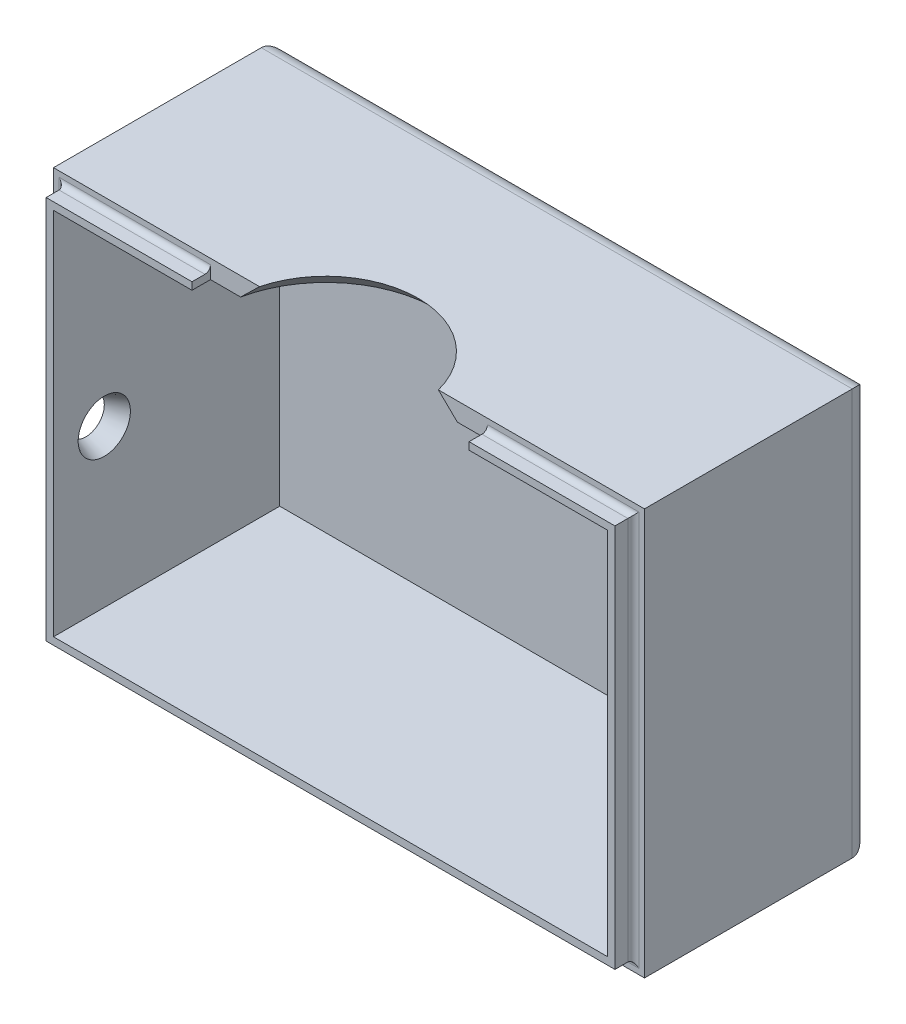
ISO-10303-21;
HEADER;
FILE_DESCRIPTION(('STEP AP214'),'2;1');
FILE_NAME('part.step','',(''),(''),'','','');
FILE_SCHEMA(('AUTOMOTIVE_DESIGN { 1 0 10303 214 1 1 1 1 }'));
ENDSEC;
DATA;
#1=APPLICATION_CONTEXT('core data for automotive mechanical design processes');
#2=APPLICATION_PROTOCOL_DEFINITION('international standard','automotive_design',2000,#1);
#3=PRODUCT_CONTEXT('',#1,'mechanical');
#4=PRODUCT('Part','Part','',(#3));
#5=PRODUCT_RELATED_PRODUCT_CATEGORY('part','',(#4));
#6=PRODUCT_DEFINITION_FORMATION('','',#4);
#7=PRODUCT_DEFINITION_CONTEXT('part definition',#1,'design');
#8=PRODUCT_DEFINITION('design','',#6,#7);
#9=PRODUCT_DEFINITION_SHAPE('','',#8);
#10=(LENGTH_UNIT() NAMED_UNIT(*) SI_UNIT(.MILLI.,.METRE.));
#11=(NAMED_UNIT(*) PLANE_ANGLE_UNIT() SI_UNIT($,.RADIAN.));
#12=(NAMED_UNIT(*) SI_UNIT($,.STERADIAN.) SOLID_ANGLE_UNIT());
#13=UNCERTAINTY_MEASURE_WITH_UNIT(LENGTH_MEASURE(1.E-05),#10,'distance_accuracy_value','');
#14=(GEOMETRIC_REPRESENTATION_CONTEXT(3) GLOBAL_UNCERTAINTY_ASSIGNED_CONTEXT((#13)) GLOBAL_UNIT_ASSIGNED_CONTEXT((#10,
#11,#12)) REPRESENTATION_CONTEXT('',''));
#15=CARTESIAN_POINT('',(0.,0.,0.));
#16=DIRECTION('',(0.,0.,1.));
#17=DIRECTION('',(1.,0.,0.));
#18=AXIS2_PLACEMENT_3D('',#15,#16,#17);
#19=CARTESIAN_POINT('',(0.,0.,0.));
#20=DIRECTION('',(0.,0.,1.));
#21=DIRECTION('',(1.,0.,0.));
#22=AXIS2_PLACEMENT_3D('',#19,#20,#21);
#23=PLANE('',#22);
#24=DIRECTION('',(-1.,0.,0.));
#25=VECTOR('',#24,1.);
#26=CARTESIAN_POINT('',(0.,32.1885923087167,0.));
#27=LINE('',#26,#25);
#28=CARTESIAN_POINT('',(-40.4459611260558,32.1885923087167,0.));
#29=VERTEX_POINT('',#28);
#30=CARTESIAN_POINT('',(-19.6179611260558,32.1885923087167,0.));
#31=VERTEX_POINT('',#30);
#32=EDGE_CURVE('E384',#29,#31,#27,.F.);
#33=ORIENTED_EDGE('',*,*,#32,.T.);
#34=DIRECTION('',(0.,1.,0.));
#35=VECTOR('',#34,1.);
#36=CARTESIAN_POINT('',(-19.6179611260558,30.4105923087167,0.));
#37=LINE('',#36,#35);
#38=CARTESIAN_POINT('',(-19.6179611260558,30.4105923087167,0.));
#39=VERTEX_POINT('',#38);
#40=EDGE_CURVE('E219',#39,#31,#37,.T.);
#41=ORIENTED_EDGE('',*,*,#40,.F.);
#42=DIRECTION('',(-1.,0.,0.));
#43=VECTOR('',#42,1.);
#44=CARTESIAN_POINT('',(-38.6679611260558,30.4105923087167,0.));
#45=LINE('',#44,#43);
#46=CARTESIAN_POINT('',(-15.4735632608238,30.4105923087167,0.));
#47=VERTEX_POINT('',#46);
#48=EDGE_CURVE('E271',#47,#39,#45,.T.);
#49=ORIENTED_EDGE('',*,*,#48,.F.);
#50=CARTESIAN_POINT('',(-15.4735632608238,30.4105923087167,0.));
#51=CARTESIAN_POINT('',(-15.2566395348124,30.6227545477112,0.));
#52=CARTESIAN_POINT('',(-15.0396170005585,30.8348158274016,0.));
#53=CARTESIAN_POINT('',(-14.6053429877258,31.258703141404,0.));
#54=CARTESIAN_POINT('',(-14.3880915095054,31.4705291760834,0.));
#55=CARTESIAN_POINT('',(-13.9533275172903,31.893913420181,0.));
#56=CARTESIAN_POINT('',(-13.7358150031931,32.1054716294941,0.));
#57=CARTESIAN_POINT('',(-13.3004868471899,32.528276603205,0.));
#58=CARTESIAN_POINT('',(-13.0826712048098,32.7395233671145,0.));
#59=CARTESIAN_POINT('',(-12.8646832502643,32.9505923087167,0.));
#60=B_SPLINE_CURVE_WITH_KNOTS('',3,(#50,#51,#52,#53,#54,#55,#56,#57,#58,#59),.UNSPECIFIED.,.F.,
.F.,(4,2,2,2,4),(0.,0.910284860639139,1.82056829776038,2.73085209228317,3.64113731247534),.UNSPECIFIED.);
#61=CARTESIAN_POINT('',(-12.8646832502643,32.9505923087167,0.));
#62=VERTEX_POINT('',#61);
#63=EDGE_CURVE('E321',#47,#62,#60,.T.);
#64=ORIENTED_EDGE('',*,*,#63,.T.);
#65=DIRECTION('',(-1.,0.,0.));
#66=VECTOR('',#65,1.);
#67=CARTESIAN_POINT('',(-41.2079611260558,32.9505923087167,0.));
#68=LINE('',#67,#66);
#69=CARTESIAN_POINT('',(-41.2079611260558,32.9505923087167,0.));
#70=VERTEX_POINT('',#69);
#71=EDGE_CURVE('E296',#62,#70,#68,.T.);
#72=ORIENTED_EDGE('',*,*,#71,.T.);
#73=DIRECTION('',(0.,-1.,0.));
#74=VECTOR('',#73,1.);
#75=CARTESIAN_POINT('',(-41.2079611260558,32.9505923087167,0.));
#76=LINE('',#75,#74);
#77=CARTESIAN_POINT('',(-41.2079611260558,-22.9294076912833,0.));
#78=VERTEX_POINT('',#77);
#79=EDGE_CURVE('E199',#70,#78,#76,.T.);
#80=ORIENTED_EDGE('',*,*,#79,.T.);
#81=DIRECTION('',(1.,0.,0.));
#82=VECTOR('',#81,1.);
#83=CARTESIAN_POINT('',(-41.2079611260558,-22.9294076912833,0.));
#84=LINE('',#83,#82);
#85=CARTESIAN_POINT('',(40.0720388739442,-22.9294076912833,0.));
#86=VERTEX_POINT('',#85);
#87=EDGE_CURVE('E290',#78,#86,#84,.T.);
#88=ORIENTED_EDGE('',*,*,#87,.T.);
#89=DIRECTION('',(0.,1.,0.));
#90=VECTOR('',#89,1.);
#91=CARTESIAN_POINT('',(40.0720388739442,32.9505923087167,0.));
#92=LINE('',#91,#90);
#93=CARTESIAN_POINT('',(40.0720388739442,32.9505923087167,0.));
#94=VERTEX_POINT('',#93);
#95=EDGE_CURVE('E293',#86,#94,#92,.T.);
#96=ORIENTED_EDGE('',*,*,#95,.T.);
#97=CARTESIAN_POINT('',(11.7287609981528,32.9505923087167,0.));
#98=VERTEX_POINT('',#97);
#99=EDGE_CURVE('E297',#94,#98,#68,.T.);
#100=ORIENTED_EDGE('',*,*,#99,.T.);
#101=CARTESIAN_POINT('',(11.7287609981528,32.9505923087167,0.));
#102=CARTESIAN_POINT('',(11.9467489526983,32.7395233671145,0.));
#103=CARTESIAN_POINT('',(12.1645645950784,32.528276603205,0.));
#104=CARTESIAN_POINT('',(12.5998927510815,32.1054716294941,0.));
#105=CARTESIAN_POINT('',(12.8174052651788,31.893913420181,0.));
#106=CARTESIAN_POINT('',(13.2521692573939,31.4705291760834,0.));
#107=CARTESIAN_POINT('',(13.4694207356142,31.258703141404,0.));
#108=CARTESIAN_POINT('',(13.903694748447,30.8348158274016,0.));
#109=CARTESIAN_POINT('',(14.1207172827008,30.6227545477112,0.));
#110=CARTESIAN_POINT('',(14.3376410087122,30.4105923087167,0.));
#111=B_SPLINE_CURVE_WITH_KNOTS('',3,(#101,#102,#103,#104,#105,#106,#107,#108,#109,#110),
.UNSPECIFIED.,.F.,.F.,(4,2,2,2,4),(0.,0.910285220192171,1.82056901471496,2.73085245183621,
3.64113731247534),.UNSPECIFIED.);
#112=CARTESIAN_POINT('',(14.3376410087122,30.4105923087167,0.));
#113=VERTEX_POINT('',#112);
#114=EDGE_CURVE('E314',#98,#113,#111,.T.);
#115=ORIENTED_EDGE('',*,*,#114,.T.);
#116=CARTESIAN_POINT('',(18.4820388739442,30.4105923087167,0.));
#117=VERTEX_POINT('',#116);
#118=EDGE_CURVE('E274',#117,#113,#45,.T.);
#119=ORIENTED_EDGE('',*,*,#118,.F.);
#120=DIRECTION('',(0.,-1.,0.));
#121=VECTOR('',#120,1.);
#122=CARTESIAN_POINT('',(18.4820388739442,31.4265923087167,0.));
#123=LINE('',#122,#121);
#124=CARTESIAN_POINT('',(18.4820388739442,32.1885923087167,0.));
#125=VERTEX_POINT('',#124);
#126=EDGE_CURVE('E217',#125,#117,#123,.T.);
#127=ORIENTED_EDGE('',*,*,#126,.F.);
#128=DIRECTION('',(-1.,0.,0.));
#129=VECTOR('',#128,1.);
#130=CARTESIAN_POINT('',(0.,32.1885923087167,0.));
#131=LINE('',#130,#129);
#132=CARTESIAN_POINT('',(39.3100388739442,32.1885923087167,0.));
#133=VERTEX_POINT('',#132);
#134=EDGE_CURVE('E508',#125,#133,#131,.F.);
#135=ORIENTED_EDGE('',*,*,#134,.T.);
#136=DIRECTION('',(0.,1.,0.));
#137=VECTOR('',#136,1.);
#138=CARTESIAN_POINT('',(39.3100388739442,0.,0.));
#139=LINE('',#138,#137);
#140=CARTESIAN_POINT('',(39.3100388739442,-22.1674076912833,0.));
#141=VERTEX_POINT('',#140);
#142=EDGE_CURVE('E511',#133,#141,#139,.F.);
#143=ORIENTED_EDGE('',*,*,#142,.T.);
#144=DIRECTION('',(1.,0.,0.));
#145=VECTOR('',#144,1.);
#146=CARTESIAN_POINT('',(0.,-22.1674076912833,0.));
#147=LINE('',#146,#145);
#148=CARTESIAN_POINT('',(-40.4459611260558,-22.1674076912833,0.));
#149=VERTEX_POINT('',#148);
#150=EDGE_CURVE('E517',#141,#149,#147,.F.);
#151=ORIENTED_EDGE('',*,*,#150,.T.);
#152=DIRECTION('',(0.,-1.,0.));
#153=VECTOR('',#152,1.);
#154=CARTESIAN_POINT('',(-40.4459611260558,0.,0.));
#155=LINE('',#154,#153);
#156=EDGE_CURVE('E388',#149,#29,#155,.F.);
#157=ORIENTED_EDGE('',*,*,#156,.T.);
#158=EDGE_LOOP('',(#33,#41,#49,#64,#72,#80,#88,#96,#100,#115,#119,#127,#135,#143,#151,#157));
#159=FACE_BOUND('',#158,.T.);
#160=ADVANCED_FACE('F35',(#159),#23,.T.);
#161=CARTESIAN_POINT('',(-41.2079611260558,32.9505923087167,-28.575));
#162=DIRECTION('',(-1.,0.,0.));
#163=DIRECTION('',(0.,0.,1.));
#164=AXIS2_PLACEMENT_3D('',#161,#162,#163);
#165=PLANE('',#164);
#166=CARTESIAN_POINT('',(-41.2079611260558,1.20059230871669,-4.445));
#167=DIRECTION('',(-1.,0.,0.));
#168=DIRECTION('',(0.,0.,1.));
#169=AXIS2_PLACEMENT_3D('',#166,#167,#168);
#170=CIRCLE('',#169,2.54);
#171=CARTESIAN_POINT('',(-41.2079611260558,1.20059230871669,-6.98500000000001));
#172=VERTEX_POINT('',#171);
#173=EDGE_CURVE('E268',#172,#172,#170,.T.);
#174=ORIENTED_EDGE('',*,*,#173,.F.);
#175=EDGE_LOOP('',(#174));
#176=FACE_BOUND('',#175,.T.);
#177=DIRECTION('',(0.,0.,1.));
#178=VECTOR('',#177,1.);
#179=CARTESIAN_POINT('',(-41.2079611260558,32.9505923087167,-28.575));
#180=LINE('',#179,#178);
#181=CARTESIAN_POINT('',(-41.2079611260558,32.9505923087167,-28.575));
#182=VERTEX_POINT('',#181);
#183=EDGE_CURVE('E301',#182,#70,#180,.T.);
#184=ORIENTED_EDGE('',*,*,#183,.F.);
#185=DIRECTION('',(0.,1.,0.));
#186=VECTOR('',#185,1.);
#187=CARTESIAN_POINT('',(-41.2079611260558,32.9505923087167,-28.575));
#188=LINE('',#187,#186);
#189=CARTESIAN_POINT('',(-41.2079611260558,-22.9294076912833,-28.575));
#190=VERTEX_POINT('',#189);
#191=EDGE_CURVE('E44',#182,#190,#188,.F.);
#192=ORIENTED_EDGE('',*,*,#191,.T.);
#193=DIRECTION('',(0.,0.,1.));
#194=VECTOR('',#193,1.);
#195=CARTESIAN_POINT('',(-41.2079611260558,-22.9294076912833,-28.575));
#196=LINE('',#195,#194);
#197=EDGE_CURVE('E300',#190,#78,#196,.T.);
#198=ORIENTED_EDGE('',*,*,#197,.T.);
#199=ORIENTED_EDGE('',*,*,#79,.F.);
#200=EDGE_LOOP('',(#184,#192,#198,#199));
#201=FACE_BOUND('',#200,.T.);
#202=ADVANCED_FACE('F374',(#176,#201),#165,.T.);
#203=CARTESIAN_POINT('',(-41.2079611260558,32.9505923087167,-28.575));
#204=DIRECTION('',(0.,1.,0.));
#205=DIRECTION('',(0.,0.,1.));
#206=AXIS2_PLACEMENT_3D('',#203,#204,#205);
#207=PLANE('',#206);
#208=DIRECTION('',(0.,0.,1.));
#209=VECTOR('',#208,1.);
#210=CARTESIAN_POINT('',(40.0720388739442,32.9505923087167,-28.575));
#211=LINE('',#210,#209);
#212=CARTESIAN_POINT('',(40.0720388739442,32.9505923087167,-28.575));
#213=VERTEX_POINT('',#212);
#214=EDGE_CURVE('E304',#213,#94,#211,.T.);
#215=ORIENTED_EDGE('',*,*,#214,.F.);
#216=DIRECTION('',(1.,0.,0.));
#217=VECTOR('',#216,1.);
#218=CARTESIAN_POINT('',(-41.2079611260558,32.9505923087167,-28.575));
#219=LINE('',#218,#217);
#220=EDGE_CURVE('E11',#213,#182,#219,.F.);
#221=ORIENTED_EDGE('',*,*,#220,.T.);
#222=ORIENTED_EDGE('',*,*,#183,.T.);
#223=ORIENTED_EDGE('',*,*,#71,.F.);
#224=CARTESIAN_POINT('',(-0.567961126055776,32.9505923087167,3.175));
#225=DIRECTION('',(0.,1.,0.));
#226=DIRECTION('',(0.,0.,1.));
#227=AXIS2_PLACEMENT_3D('',#224,#225,#226);
#228=CIRCLE('',#227,12.7);
#229=EDGE_CURVE('E265',#98,#62,#228,.T.);
#230=ORIENTED_EDGE('',*,*,#229,.F.);
#231=ORIENTED_EDGE('',*,*,#99,.F.);
#232=EDGE_LOOP('',(#215,#221,#222,#223,#230,#231));
#233=FACE_BOUND('',#232,.T.);
#234=ADVANCED_FACE('F379',(#233),#207,.T.);
#235=CARTESIAN_POINT('',(40.0720388739442,32.9505923087167,-28.575));
#236=DIRECTION('',(1.,0.,0.));
#237=DIRECTION('',(0.,1.,0.));
#238=AXIS2_PLACEMENT_3D('',#235,#236,#237);
#239=PLANE('',#238);
#240=DIRECTION('',(0.,0.,1.));
#241=VECTOR('',#240,1.);
#242=CARTESIAN_POINT('',(40.0720388739442,-22.9294076912833,-28.575));
#243=LINE('',#242,#241);
#244=CARTESIAN_POINT('',(40.0720388739442,-22.9294076912833,-28.575));
#245=VERTEX_POINT('',#244);
#246=EDGE_CURVE('E306',#245,#86,#243,.T.);
#247=ORIENTED_EDGE('',*,*,#246,.F.);
#248=DIRECTION('',(0.,-1.,0.));
#249=VECTOR('',#248,1.);
#250=CARTESIAN_POINT('',(40.0720388739442,32.9505923087167,-28.575));
#251=LINE('',#250,#249);
#252=EDGE_CURVE('E426',#245,#213,#251,.F.);
#253=ORIENTED_EDGE('',*,*,#252,.T.);
#254=ORIENTED_EDGE('',*,*,#214,.T.);
#255=ORIENTED_EDGE('',*,*,#95,.F.);
#256=EDGE_LOOP('',(#247,#253,#254,#255));
#257=FACE_BOUND('',#256,.T.);
#258=ADVANCED_FACE('F452',(#257),#239,.T.);
#259=CARTESIAN_POINT('',(-41.2079611260558,-22.9294076912833,-28.575));
#260=DIRECTION('',(0.,-1.,0.));
#261=DIRECTION('',(0.,0.,-1.));
#262=AXIS2_PLACEMENT_3D('',#259,#260,#261);
#263=PLANE('',#262);
#264=ORIENTED_EDGE('',*,*,#197,.F.);
#265=DIRECTION('',(-1.,0.,0.));
#266=VECTOR('',#265,1.);
#267=CARTESIAN_POINT('',(-41.2079611260558,-22.9294076912833,-28.575));
#268=LINE('',#267,#266);
#269=EDGE_CURVE('E429',#190,#245,#268,.F.);
#270=ORIENTED_EDGE('',*,*,#269,.T.);
#271=ORIENTED_EDGE('',*,*,#246,.T.);
#272=ORIENTED_EDGE('',*,*,#87,.F.);
#273=EDGE_LOOP('',(#264,#270,#271,#272));
#274=FACE_BOUND('',#273,.T.);
#275=ADVANCED_FACE('F447',(#274),#263,.T.);
#276=CARTESIAN_POINT('',(-38.6679611260558,30.4105923087167,-28.575));
#277=DIRECTION('',(-1.,0.,0.));
#278=DIRECTION('',(0.,0.,1.));
#279=AXIS2_PLACEMENT_3D('',#276,#277,#278);
#280=PLANE('',#279);
#281=CARTESIAN_POINT('',(-38.6679611260558,1.20059230871669,-4.445));
#282=DIRECTION('',(-1.,0.,0.));
#283=DIRECTION('',(0.,0.,1.));
#284=AXIS2_PLACEMENT_3D('',#281,#282,#283);
#285=CIRCLE('',#284,3.59210244842766);
#286=CARTESIAN_POINT('',(-38.6679611260558,1.20059230871669,-8.03710244842767));
#287=VERTEX_POINT('',#286);
#288=EDGE_CURVE('E303',#287,#287,#285,.T.);
#289=ORIENTED_EDGE('',*,*,#288,.T.);
#290=EDGE_LOOP('',(#289));
#291=FACE_BOUND('',#290,.T.);
#292=DIRECTION('',(0.,0.,1.));
#293=VECTOR('',#292,1.);
#294=CARTESIAN_POINT('',(-38.6679611260558,30.4105923087167,-28.575));
#295=LINE('',#294,#293);
#296=CARTESIAN_POINT('',(-38.6679611260558,30.4105923087167,-28.575));
#297=VERTEX_POINT('',#296);
#298=CARTESIAN_POINT('',(-38.6679611260558,30.4105923087167,2.54));
#299=VERTEX_POINT('',#298);
#300=EDGE_CURVE('E190',#297,#299,#295,.T.);
#301=ORIENTED_EDGE('',*,*,#300,.T.);
#302=DIRECTION('',(0.,1.,0.));
#303=VECTOR('',#302,1.);
#304=CARTESIAN_POINT('',(-38.6679611260558,30.4105923087167,2.54));
#305=LINE('',#304,#303);
#306=CARTESIAN_POINT('',(-38.6679611260558,-20.3894076912833,2.54));
#307=VERTEX_POINT('',#306);
#308=EDGE_CURVE('E194',#307,#299,#305,.T.);
#309=ORIENTED_EDGE('',*,*,#308,.F.);
#310=DIRECTION('',(0.,0.,1.));
#311=VECTOR('',#310,1.);
#312=CARTESIAN_POINT('',(-38.6679611260558,-20.3894076912833,-28.575));
#313=LINE('',#312,#311);
#314=CARTESIAN_POINT('',(-38.6679611260558,-20.3894076912833,-28.575));
#315=VERTEX_POINT('',#314);
#316=EDGE_CURVE('E282',#315,#307,#313,.T.);
#317=ORIENTED_EDGE('',*,*,#316,.F.);
#318=DIRECTION('',(0.,-1.,0.));
#319=VECTOR('',#318,1.);
#320=CARTESIAN_POINT('',(-38.6679611260558,30.4105923087167,-28.575));
#321=LINE('',#320,#319);
#322=EDGE_CURVE('E196',#297,#315,#321,.T.);
#323=ORIENTED_EDGE('',*,*,#322,.F.);
#324=EDGE_LOOP('',(#301,#309,#317,#323));
#325=FACE_BOUND('',#324,.T.);
#326=ADVANCED_FACE('F192',(#291,#325),#280,.F.);
#327=CARTESIAN_POINT('',(-38.6679611260558,30.4105923087167,-28.575));
#328=DIRECTION('',(0.,1.,0.));
#329=DIRECTION('',(0.,0.,1.));
#330=AXIS2_PLACEMENT_3D('',#327,#328,#329);
#331=PLANE('',#330);
#332=ORIENTED_EDGE('',*,*,#118,.T.);
#333=CARTESIAN_POINT('',(-0.567961126055776,30.4105923087167,3.175));
#334=DIRECTION('',(0.,1.,0.));
#335=DIRECTION('',(0.,0.,1.));
#336=AXIS2_PLACEMENT_3D('',#333,#334,#335);
#337=CIRCLE('',#336,15.24);
#338=EDGE_CURVE('E311',#113,#47,#337,.T.);
#339=ORIENTED_EDGE('',*,*,#338,.T.);
#340=ORIENTED_EDGE('',*,*,#48,.T.);
#341=DIRECTION('',(0.,0.,-1.));
#342=VECTOR('',#341,1.);
#343=CARTESIAN_POINT('',(-19.6179611260558,30.4105923087167,2.54));
#344=LINE('',#343,#342);
#345=CARTESIAN_POINT('',(-19.6179611260558,30.4105923087167,2.54));
#346=VERTEX_POINT('',#345);
#347=EDGE_CURVE('E207',#346,#39,#344,.T.);
#348=ORIENTED_EDGE('',*,*,#347,.F.);
#349=DIRECTION('',(1.,0.,0.));
#350=VECTOR('',#349,1.);
#351=CARTESIAN_POINT('',(-38.6679611260558,30.4105923087167,2.54));
#352=LINE('',#351,#350);
#353=EDGE_CURVE('E203',#299,#346,#352,.T.);
#354=ORIENTED_EDGE('',*,*,#353,.F.);
#355=ORIENTED_EDGE('',*,*,#300,.F.);
#356=DIRECTION('',(-1.,0.,0.));
#357=VECTOR('',#356,1.);
#358=CARTESIAN_POINT('',(-38.6679611260558,30.4105923087167,-28.575));
#359=LINE('',#358,#357);
#360=CARTESIAN_POINT('',(37.5320388739442,30.4105923087167,-28.575));
#361=VERTEX_POINT('',#360);
#362=EDGE_CURVE('E280',#361,#297,#359,.T.);
#363=ORIENTED_EDGE('',*,*,#362,.F.);
#364=DIRECTION('',(0.,0.,1.));
#365=VECTOR('',#364,1.);
#366=CARTESIAN_POINT('',(37.5320388739442,30.4105923087167,-28.575));
#367=LINE('',#366,#365);
#368=CARTESIAN_POINT('',(37.5320388739442,30.4105923087167,2.54));
#369=VERTEX_POINT('',#368);
#370=EDGE_CURVE('E200',#361,#369,#367,.T.);
#371=ORIENTED_EDGE('',*,*,#370,.T.);
#372=DIRECTION('',(1.,0.,0.));
#373=VECTOR('',#372,1.);
#374=CARTESIAN_POINT('',(37.5320388739442,30.4105923087167,2.54));
#375=LINE('',#374,#373);
#376=CARTESIAN_POINT('',(18.4820388739442,30.4105923087167,2.54));
#377=VERTEX_POINT('',#376);
#378=EDGE_CURVE('E235',#377,#369,#375,.T.);
#379=ORIENTED_EDGE('',*,*,#378,.F.);
#380=DIRECTION('',(0.,0.,-1.));
#381=VECTOR('',#380,1.);
#382=CARTESIAN_POINT('',(18.4820388739442,30.4105923087167,2.54));
#383=LINE('',#382,#381);
#384=EDGE_CURVE('E241',#377,#117,#383,.T.);
#385=ORIENTED_EDGE('',*,*,#384,.T.);
#386=EDGE_LOOP('',(#332,#339,#340,#348,#354,#355,#363,#371,#379,#385));
#387=FACE_BOUND('',#386,.T.);
#388=ADVANCED_FACE('F205',(#387),#331,.F.);
#389=CARTESIAN_POINT('',(37.5320388739442,30.4105923087167,-28.575));
#390=DIRECTION('',(1.,0.,0.));
#391=DIRECTION('',(0.,0.,-1.));
#392=AXIS2_PLACEMENT_3D('',#389,#390,#391);
#393=PLANE('',#392);
#394=DIRECTION('',(0.,0.,1.));
#395=VECTOR('',#394,1.);
#396=CARTESIAN_POINT('',(37.5320388739442,-20.3894076912833,-28.575));
#397=LINE('',#396,#395);
#398=CARTESIAN_POINT('',(37.5320388739442,-20.3894076912833,-28.575));
#399=VERTEX_POINT('',#398);
#400=CARTESIAN_POINT('',(37.5320388739442,-20.3894076912833,2.54));
#401=VERTEX_POINT('',#400);
#402=EDGE_CURVE('E285',#399,#401,#397,.T.);
#403=ORIENTED_EDGE('',*,*,#402,.T.);
#404=DIRECTION('',(0.,-1.,0.));
#405=VECTOR('',#404,1.);
#406=CARTESIAN_POINT('',(37.5320388739442,30.4105923087167,2.54));
#407=LINE('',#406,#405);
#408=EDGE_CURVE('E238',#369,#401,#407,.T.);
#409=ORIENTED_EDGE('',*,*,#408,.F.);
#410=ORIENTED_EDGE('',*,*,#370,.F.);
#411=DIRECTION('',(0.,1.,0.));
#412=VECTOR('',#411,1.);
#413=CARTESIAN_POINT('',(37.5320388739442,30.4105923087167,-28.575));
#414=LINE('',#413,#412);
#415=EDGE_CURVE('E277',#399,#361,#414,.T.);
#416=ORIENTED_EDGE('',*,*,#415,.F.);
#417=EDGE_LOOP('',(#403,#409,#410,#416));
#418=FACE_BOUND('',#417,.T.);
#419=ADVANCED_FACE('F473',(#418),#393,.F.);
#420=CARTESIAN_POINT('',(-38.6679611260558,-20.3894076912833,-28.575));
#421=DIRECTION('',(0.,-1.,0.));
#422=DIRECTION('',(0.,0.,-1.));
#423=AXIS2_PLACEMENT_3D('',#420,#421,#422);
#424=PLANE('',#423);
#425=ORIENTED_EDGE('',*,*,#316,.T.);
#426=DIRECTION('',(-1.,0.,0.));
#427=VECTOR('',#426,1.);
#428=CARTESIAN_POINT('',(-38.6679611260558,-20.3894076912833,2.54));
#429=LINE('',#428,#427);
#430=EDGE_CURVE('E216',#401,#307,#429,.T.);
#431=ORIENTED_EDGE('',*,*,#430,.F.);
#432=ORIENTED_EDGE('',*,*,#402,.F.);
#433=DIRECTION('',(1.,0.,0.));
#434=VECTOR('',#433,1.);
#435=CARTESIAN_POINT('',(-38.6679611260558,-20.3894076912833,-28.575));
#436=LINE('',#435,#434);
#437=EDGE_CURVE('E273',#315,#399,#436,.T.);
#438=ORIENTED_EDGE('',*,*,#437,.F.);
#439=EDGE_LOOP('',(#425,#431,#432,#438));
#440=FACE_BOUND('',#439,.T.);
#441=ADVANCED_FACE('F465',(#440),#424,.F.);
#442=CARTESIAN_POINT('',(0.,0.,-28.575));
#443=DIRECTION('',(0.,0.,-1.));
#444=DIRECTION('',(-1.,0.,0.));
#445=AXIS2_PLACEMENT_3D('',#442,#443,#444);
#446=PLANE('',#445);
#447=ORIENTED_EDGE('',*,*,#415,.T.);
#448=ORIENTED_EDGE('',*,*,#362,.T.);
#449=ORIENTED_EDGE('',*,*,#322,.T.);
#450=ORIENTED_EDGE('',*,*,#437,.T.);
#451=EDGE_LOOP('',(#447,#448,#449,#450));
#452=FACE_BOUND('',#451,.T.);
#453=ADVANCED_FACE('F457',(#452),#446,.F.);
#454=CARTESIAN_POINT('',(0.,0.,-31.115));
#455=DIRECTION('',(0.,0.,-1.));
#456=DIRECTION('',(-1.,0.,0.));
#457=AXIS2_PLACEMENT_3D('',#454,#455,#456);
#458=PLANE('',#457);
#459=DIRECTION('',(1.,0.,0.));
#460=VECTOR('',#459,1.);
#461=CARTESIAN_POINT('',(0.,30.4105923087167,-31.115));
#462=LINE('',#461,#460);
#463=CARTESIAN_POINT('',(-38.6679611260558,30.4105923087167,-31.115));
#464=VERTEX_POINT('',#463);
#465=CARTESIAN_POINT('',(37.5320388739442,30.4105923087167,-31.115));
#466=VERTEX_POINT('',#465);
#467=EDGE_CURVE('E402',#464,#466,#462,.T.);
#468=ORIENTED_EDGE('',*,*,#467,.T.);
#469=DIRECTION('',(0.,-1.,0.));
#470=VECTOR('',#469,1.);
#471=CARTESIAN_POINT('',(37.5320388739442,0.,-31.115));
#472=LINE('',#471,#470);
#473=CARTESIAN_POINT('',(37.5320388739442,-20.3894076912833,-31.115));
#474=VERTEX_POINT('',#473);
#475=EDGE_CURVE('E423',#466,#474,#472,.T.);
#476=ORIENTED_EDGE('',*,*,#475,.T.);
#477=DIRECTION('',(-1.,0.,0.));
#478=VECTOR('',#477,1.);
#479=CARTESIAN_POINT('',(0.,-20.3894076912833,-31.115));
#480=LINE('',#479,#478);
#481=CARTESIAN_POINT('',(-38.6679611260558,-20.3894076912833,-31.115));
#482=VERTEX_POINT('',#481);
#483=EDGE_CURVE('E421',#474,#482,#480,.T.);
#484=ORIENTED_EDGE('',*,*,#483,.T.);
#485=DIRECTION('',(0.,1.,0.));
#486=VECTOR('',#485,1.);
#487=CARTESIAN_POINT('',(-38.6679611260558,0.,-31.115));
#488=LINE('',#487,#486);
#489=EDGE_CURVE('E419',#482,#464,#488,.T.);
#490=ORIENTED_EDGE('',*,*,#489,.T.);
#491=EDGE_LOOP('',(#468,#476,#484,#490));
#492=FACE_BOUND('',#491,.T.);
#493=ADVANCED_FACE('F455',(#492),#458,.T.);
#494=CARTESIAN_POINT('',(-38.6679611260558,1.20059230871669,-4.445));
#495=DIRECTION('',(1.,0.,0.));
#496=DIRECTION('',(0.,0.,-1.));
#497=AXIS2_PLACEMENT_3D('',#494,#495,#496);
#498=CONICAL_SURFACE('',#497,3.59210244842766,0.392699081698722);
#499=CARTESIAN_POINT('',(-41.2079611260558,1.20059230871669,-6.98500000000001));
#500=CARTESIAN_POINT('',(-41.1815027927224,1.20059230871669,-6.99595940050446));
#501=CARTESIAN_POINT('',(-41.1550444593891,1.20059230871669,-7.00691880100892));
#502=CARTESIAN_POINT('',(-41.1021277927224,1.20059230871669,-7.02883760201783));
#503=CARTESIAN_POINT('',(-41.0756694593891,1.20059230871669,-7.03979700252228));
#504=CARTESIAN_POINT('',(-41.0227527927224,1.20059230871669,-7.06171580353119));
#505=CARTESIAN_POINT('',(-40.9962944593891,1.20059230871669,-7.07267520403565));
#506=CARTESIAN_POINT('',(-40.9433777927224,1.20059230871669,-7.09459400504456));
#507=CARTESIAN_POINT('',(-40.9169194593891,1.20059230871669,-7.10555340554901));
#508=CARTESIAN_POINT('',(-40.8640027927224,1.20059230871669,-7.12747220655792));
#509=CARTESIAN_POINT('',(-40.8375444593891,1.20059230871669,-7.13843160706238));
#510=CARTESIAN_POINT('',(-40.7846277927224,1.20059230871669,-7.16035040807128));
#511=CARTESIAN_POINT('',(-40.7581694593891,1.20059230871669,-7.17130980857574));
#512=CARTESIAN_POINT('',(-40.7052527927224,1.20059230871669,-7.19322860958465));
#513=CARTESIAN_POINT('',(-40.6787944593891,1.20059230871669,-7.2041880100891));
#514=CARTESIAN_POINT('',(-40.6258777927224,1.20059230871669,-7.22610681109801));
#515=CARTESIAN_POINT('',(-40.5994194593891,1.20059230871669,-7.23706621160247));
#516=CARTESIAN_POINT('',(-40.5465027927224,1.20059230871669,-7.25898501261138));
#517=CARTESIAN_POINT('',(-40.5200444593891,1.20059230871669,-7.26994441311583));
#518=CARTESIAN_POINT('',(-40.4671277927224,1.20059230871669,-7.29186321412474));
#519=CARTESIAN_POINT('',(-40.4406694593891,1.20059230871669,-7.3028226146292));
#520=CARTESIAN_POINT('',(-40.3877527927224,1.20059230871669,-7.32474141563811));
#521=CARTESIAN_POINT('',(-40.3612944593891,1.20059230871669,-7.33570081614256));
#522=CARTESIAN_POINT('',(-40.3083777927224,1.20059230871669,-7.35761961715147));
#523=CARTESIAN_POINT('',(-40.2819194593891,1.20059230871669,-7.36857901765592));
#524=CARTESIAN_POINT('',(-40.2290027927224,1.20059230871669,-7.39049781866483));
#525=CARTESIAN_POINT('',(-40.2025444593891,1.20059230871669,-7.40145721916929));
#526=CARTESIAN_POINT('',(-40.1496277927224,1.20059230871669,-7.4233760201782));
#527=CARTESIAN_POINT('',(-40.1231694593891,1.20059230871669,-7.43433542068265));
#528=CARTESIAN_POINT('',(-40.0702527927224,1.20059230871669,-7.45625422169156));
#529=CARTESIAN_POINT('',(-40.0437944593891,1.20059230871669,-7.46721362219602));
#530=CARTESIAN_POINT('',(-39.9908777927224,1.20059230871669,-7.48913242320493));
#531=CARTESIAN_POINT('',(-39.9644194593891,1.20059230871669,-7.50009182370938));
#532=CARTESIAN_POINT('',(-39.9115027927224,1.20059230871669,-7.52201062471829));
#533=CARTESIAN_POINT('',(-39.8850444593891,1.20059230871669,-7.53297002522275));
#534=CARTESIAN_POINT('',(-39.8321277927224,1.20059230871669,-7.55488882623166));
#535=CARTESIAN_POINT('',(-39.8056694593891,1.20059230871669,-7.56584822673611));
#536=CARTESIAN_POINT('',(-39.7527527927224,1.20059230871669,-7.58776702774502));
#537=CARTESIAN_POINT('',(-39.7262944593891,1.20059230871669,-7.59872642824948));
#538=CARTESIAN_POINT('',(-39.6733777927224,1.20059230871669,-7.62064522925838));
#539=CARTESIAN_POINT('',(-39.6469194593891,1.20059230871669,-7.63160462976284));
#540=CARTESIAN_POINT('',(-39.5940027927224,1.20059230871669,-7.65352343077175));
#541=CARTESIAN_POINT('',(-39.5675444593891,1.20059230871669,-7.6644828312762));
#542=CARTESIAN_POINT('',(-39.5146277927224,1.20059230871669,-7.68640163228511));
#543=CARTESIAN_POINT('',(-39.4881694593891,1.20059230871669,-7.69736103278957));
#544=CARTESIAN_POINT('',(-39.4352527927224,1.20059230871669,-7.71927983379848));
#545=CARTESIAN_POINT('',(-39.4087944593891,1.20059230871669,-7.73023923430293));
#546=CARTESIAN_POINT('',(-39.3558777927224,1.20059230871669,-7.75215803531184));
#547=CARTESIAN_POINT('',(-39.3294194593891,1.20059230871669,-7.7631174358163));
#548=CARTESIAN_POINT('',(-39.2765027927224,1.20059230871669,-7.78503623682521));
#549=CARTESIAN_POINT('',(-39.2500444593891,1.20059230871669,-7.79599563732966));
#550=CARTESIAN_POINT('',(-39.1971277927224,1.20059230871669,-7.81791443833857));
#551=CARTESIAN_POINT('',(-39.1706694593891,1.20059230871669,-7.82887383884303));
#552=CARTESIAN_POINT('',(-39.1177527927224,1.20059230871669,-7.85079263985193));
#553=CARTESIAN_POINT('',(-39.0912944593891,1.20059230871669,-7.86175204035639));
#554=CARTESIAN_POINT('',(-39.0383777927224,1.20059230871669,-7.8836708413653));
#555=CARTESIAN_POINT('',(-39.0119194593891,1.20059230871669,-7.89463024186975));
#556=CARTESIAN_POINT('',(-38.9590027927224,1.20059230871669,-7.91654904287866));
#557=CARTESIAN_POINT('',(-38.9325444593891,1.20059230871669,-7.92750844338312));
#558=CARTESIAN_POINT('',(-38.8796277927224,1.20059230871669,-7.94942724439203));
#559=CARTESIAN_POINT('',(-38.8531694593891,1.20059230871669,-7.96038664489648));
#560=CARTESIAN_POINT('',(-38.8002527927224,1.20059230871669,-7.98230544590539));
#561=CARTESIAN_POINT('',(-38.7737944593891,1.20059230871669,-7.99326484640985));
#562=CARTESIAN_POINT('',(-38.7208777927224,1.20059230871669,-8.01518364741875));
#563=CARTESIAN_POINT('',(-38.6944194593891,1.20059230871669,-8.02614304792321));
#564=CARTESIAN_POINT('',(-38.6679611260558,1.20059230871669,-8.03710244842767));
#565=B_SPLINE_CURVE_WITH_KNOTS('',3,(#499,#500,#501,#502,#503,#504,#505,#506,#507,#508,#509,
#510,#511,#512,#513,#514,#515,#516,#517,#518,#519,#520,#521,#522,#523,#524,#525,#526,#527,#528,
#529,#530,#531,#532,#533,#534,#535,#536,#537,#538,#539,#540,#541,#542,#543,#544,#545,#546,#547,
#548,#549,#550,#551,#552,#553,#554,#555,#556,#557,#558,#559,#560,#561,#562,#563,#564),
.UNSPECIFIED.,.F.,.F.,(4,2,2,2,2,2,2,2,2,2,2,2,2,2,2,2,2,2,2,2,2,2,2,2,2,2,2,2,2,2,2,2,4),(0.,
0.0859148808982083,0.171829761796417,0.257744642694625,0.343659523592833,0.429574404491042,
0.51548928538925,0.601404166287458,0.687319047185666,0.773233928083875,0.859148808982083,
0.945063689880298,1.03097857077851,1.11689345167671,1.20280833257492,1.28872321347313,
1.37463809437134,1.46055297526955,1.54646785616776,1.63238273706596,1.71829761796417,
1.80421249886238,1.8901273797606,1.9760422606588,2.06195714155701,2.14787202245522,
2.23378690335343,2.31970178425164,2.40561666514985,2.49153154604806,2.57744642694626,
2.66336130784447,2.74927618874268),.UNSPECIFIED.);
#566=EDGE_CURVE('BSEAM336',#172,#287,#565,.T.);
#567=ORIENTED_EDGE('',*,*,#173,.T.);
#568=ORIENTED_EDGE('',*,*,#288,.F.);
#569=ORIENTED_EDGE('',*,*,#566,.T.);
#570=ORIENTED_EDGE('',*,*,#566,.F.);
#571=EDGE_LOOP('',(#567,#569,#568,#570));
#572=FACE_BOUND('',#571,.T.);
#573=ADVANCED_FACE('F336',(#572),#498,.F.);
#574=CARTESIAN_POINT('',(-19.6179611260558,30.4105923087167,2.54));
#575=DIRECTION('',(-1.,0.,0.));
#576=DIRECTION('',(0.,0.,1.));
#577=AXIS2_PLACEMENT_3D('',#574,#575,#576);
#578=PLANE('',#577);
#579=ORIENTED_EDGE('',*,*,#40,.T.);
#580=CARTESIAN_POINT('',(-19.6179611260558,32.1885923087167,0.762));
#581=DIRECTION('',(-1.,0.,0.));
#582=DIRECTION('',(0.,0.,1.));
#583=AXIS2_PLACEMENT_3D('',#580,#581,#582);
#584=CIRCLE('',#583,0.762);
#585=CARTESIAN_POINT('',(-19.6179611260558,31.4265923087167,0.762));
#586=VERTEX_POINT('',#585);
#587=EDGE_CURVE('E393',#31,#586,#584,.T.);
#588=ORIENTED_EDGE('',*,*,#587,.T.);
#589=DIRECTION('',(0.,0.,-1.));
#590=VECTOR('',#589,1.);
#591=CARTESIAN_POINT('',(-19.6179611260558,31.4265923087167,2.54));
#592=LINE('',#591,#590);
#593=CARTESIAN_POINT('',(-19.6179611260558,31.4265923087167,2.54));
#594=VERTEX_POINT('',#593);
#595=EDGE_CURVE('E261',#594,#586,#592,.T.);
#596=ORIENTED_EDGE('',*,*,#595,.F.);
#597=DIRECTION('',(0.,1.,0.));
#598=VECTOR('',#597,1.);
#599=CARTESIAN_POINT('',(-19.6179611260558,30.4105923087167,2.54));
#600=LINE('',#599,#598);
#601=EDGE_CURVE('E210',#346,#594,#600,.T.);
#602=ORIENTED_EDGE('',*,*,#601,.F.);
#603=ORIENTED_EDGE('',*,*,#347,.T.);
#604=EDGE_LOOP('',(#579,#588,#596,#602,#603));
#605=FACE_BOUND('',#604,.T.);
#606=ADVANCED_FACE('F463',(#605),#578,.F.);
#607=CARTESIAN_POINT('',(-39.6839611260558,31.4265923087167,2.54));
#608=DIRECTION('',(0.,-1.,0.));
#609=DIRECTION('',(0.,0.,-1.));
#610=AXIS2_PLACEMENT_3D('',#607,#608,#609);
#611=PLANE('',#610);
#612=ORIENTED_EDGE('',*,*,#595,.T.);
#613=DIRECTION('',(-1.,0.,0.));
#614=VECTOR('',#613,1.);
#615=CARTESIAN_POINT('',(-39.6839611260558,31.4265923087167,0.762));
#616=LINE('',#615,#614);
#617=CARTESIAN_POINT('',(-39.6839611260558,31.4265923087167,0.762));
#618=VERTEX_POINT('',#617);
#619=EDGE_CURVE('E395',#586,#618,#616,.T.);
#620=ORIENTED_EDGE('',*,*,#619,.T.);
#621=DIRECTION('',(0.,0.,-1.));
#622=VECTOR('',#621,1.);
#623=CARTESIAN_POINT('',(-39.6839611260558,31.4265923087167,2.54));
#624=LINE('',#623,#622);
#625=CARTESIAN_POINT('',(-39.6839611260558,31.4265923087167,2.54));
#626=VERTEX_POINT('',#625);
#627=EDGE_CURVE('E258',#626,#618,#624,.T.);
#628=ORIENTED_EDGE('',*,*,#627,.F.);
#629=DIRECTION('',(-1.,0.,0.));
#630=VECTOR('',#629,1.);
#631=CARTESIAN_POINT('',(-39.6839611260558,31.4265923087167,2.54));
#632=LINE('',#631,#630);
#633=EDGE_CURVE('E223',#594,#626,#632,.T.);
#634=ORIENTED_EDGE('',*,*,#633,.F.);
#635=EDGE_LOOP('',(#612,#620,#628,#634));
#636=FACE_BOUND('',#635,.T.);
#637=ADVANCED_FACE('F544',(#636),#611,.F.);
#638=CARTESIAN_POINT('',(-39.6839611260558,31.4265923087167,2.54));
#639=DIRECTION('',(1.,0.,0.));
#640=DIRECTION('',(0.,1.,0.));
#641=AXIS2_PLACEMENT_3D('',#638,#639,#640);
#642=PLANE('',#641);
#643=ORIENTED_EDGE('',*,*,#627,.T.);
#644=DIRECTION('',(0.,-1.,0.));
#645=VECTOR('',#644,1.);
#646=CARTESIAN_POINT('',(-39.6839611260558,31.4265923087167,0.762));
#647=LINE('',#646,#645);
#648=CARTESIAN_POINT('',(-39.6839611260558,-21.4054076912833,0.762));
#649=VERTEX_POINT('',#648);
#650=EDGE_CURVE('E390',#618,#649,#647,.T.);
#651=ORIENTED_EDGE('',*,*,#650,.T.);
#652=DIRECTION('',(0.,0.,-1.));
#653=VECTOR('',#652,1.);
#654=CARTESIAN_POINT('',(-39.6839611260558,-21.4054076912833,2.54));
#655=LINE('',#654,#653);
#656=CARTESIAN_POINT('',(-39.6839611260558,-21.4054076912833,2.54));
#657=VERTEX_POINT('',#656);
#658=EDGE_CURVE('E255',#657,#649,#655,.T.);
#659=ORIENTED_EDGE('',*,*,#658,.F.);
#660=DIRECTION('',(0.,-1.,0.));
#661=VECTOR('',#660,1.);
#662=CARTESIAN_POINT('',(-39.6839611260558,31.4265923087167,2.54));
#663=LINE('',#662,#661);
#664=EDGE_CURVE('E225',#626,#657,#663,.T.);
#665=ORIENTED_EDGE('',*,*,#664,.F.);
#666=EDGE_LOOP('',(#643,#651,#659,#665));
#667=FACE_BOUND('',#666,.T.);
#668=ADVANCED_FACE('F546',(#667),#642,.F.);
#669=CARTESIAN_POINT('',(-39.6839611260558,-21.4054076912833,2.54));
#670=DIRECTION('',(0.,1.,0.));
#671=DIRECTION('',(0.,0.,1.));
#672=AXIS2_PLACEMENT_3D('',#669,#670,#671);
#673=PLANE('',#672);
#674=ORIENTED_EDGE('',*,*,#658,.T.);
#675=DIRECTION('',(1.,0.,0.));
#676=VECTOR('',#675,1.);
#677=CARTESIAN_POINT('',(-39.6839611260558,-21.4054076912833,0.762));
#678=LINE('',#677,#676);
#679=CARTESIAN_POINT('',(38.5480388739442,-21.4054076912833,0.762));
#680=VERTEX_POINT('',#679);
#681=EDGE_CURVE('E523',#649,#680,#678,.T.);
#682=ORIENTED_EDGE('',*,*,#681,.T.);
#683=DIRECTION('',(0.,0.,-1.));
#684=VECTOR('',#683,1.);
#685=CARTESIAN_POINT('',(38.5480388739442,-21.4054076912833,2.54));
#686=LINE('',#685,#684);
#687=CARTESIAN_POINT('',(38.5480388739442,-21.4054076912833,2.54));
#688=VERTEX_POINT('',#687);
#689=EDGE_CURVE('E252',#688,#680,#686,.T.);
#690=ORIENTED_EDGE('',*,*,#689,.F.);
#691=DIRECTION('',(1.,0.,0.));
#692=VECTOR('',#691,1.);
#693=CARTESIAN_POINT('',(-39.6839611260558,-21.4054076912833,2.54));
#694=LINE('',#693,#692);
#695=EDGE_CURVE('E227',#657,#688,#694,.T.);
#696=ORIENTED_EDGE('',*,*,#695,.F.);
#697=EDGE_LOOP('',(#674,#682,#690,#696));
#698=FACE_BOUND('',#697,.T.);
#699=ADVANCED_FACE('F537',(#698),#673,.F.);
#700=CARTESIAN_POINT('',(38.5480388739442,31.4265923087167,2.54));
#701=DIRECTION('',(-1.,0.,0.));
#702=DIRECTION('',(0.,0.,1.));
#703=AXIS2_PLACEMENT_3D('',#700,#701,#702);
#704=PLANE('',#703);
#705=ORIENTED_EDGE('',*,*,#689,.T.);
#706=DIRECTION('',(0.,1.,0.));
#707=VECTOR('',#706,1.);
#708=CARTESIAN_POINT('',(38.5480388739442,31.4265923087167,0.762));
#709=LINE('',#708,#707);
#710=CARTESIAN_POINT('',(38.5480388739442,31.4265923087167,0.762));
#711=VERTEX_POINT('',#710);
#712=EDGE_CURVE('E404',#680,#711,#709,.T.);
#713=ORIENTED_EDGE('',*,*,#712,.T.);
#714=DIRECTION('',(0.,0.,-1.));
#715=VECTOR('',#714,1.);
#716=CARTESIAN_POINT('',(38.5480388739442,31.4265923087167,2.54));
#717=LINE('',#716,#715);
#718=CARTESIAN_POINT('',(38.5480388739442,31.4265923087167,2.54));
#719=VERTEX_POINT('',#718);
#720=EDGE_CURVE('E249',#719,#711,#717,.T.);
#721=ORIENTED_EDGE('',*,*,#720,.F.);
#722=DIRECTION('',(0.,1.,0.));
#723=VECTOR('',#722,1.);
#724=CARTESIAN_POINT('',(38.5480388739442,31.4265923087167,2.54));
#725=LINE('',#724,#723);
#726=EDGE_CURVE('E229',#688,#719,#725,.T.);
#727=ORIENTED_EDGE('',*,*,#726,.F.);
#728=EDGE_LOOP('',(#705,#713,#721,#727));
#729=FACE_BOUND('',#728,.T.);
#730=ADVANCED_FACE('F526',(#729),#704,.F.);
#731=CARTESIAN_POINT('',(38.5480388739442,31.4265923087167,2.54));
#732=DIRECTION('',(0.,-1.,0.));
#733=DIRECTION('',(0.,0.,-1.));
#734=AXIS2_PLACEMENT_3D('',#731,#732,#733);
#735=PLANE('',#734);
#736=ORIENTED_EDGE('',*,*,#720,.T.);
#737=DIRECTION('',(-1.,0.,0.));
#738=VECTOR('',#737,1.);
#739=CARTESIAN_POINT('',(38.5480388739442,31.4265923087167,0.762));
#740=LINE('',#739,#738);
#741=CARTESIAN_POINT('',(18.4820388739442,31.4265923087167,0.762));
#742=VERTEX_POINT('',#741);
#743=EDGE_CURVE('E399',#711,#742,#740,.T.);
#744=ORIENTED_EDGE('',*,*,#743,.T.);
#745=DIRECTION('',(0.,0.,-1.));
#746=VECTOR('',#745,1.);
#747=CARTESIAN_POINT('',(18.4820388739442,31.4265923087167,2.54));
#748=LINE('',#747,#746);
#749=CARTESIAN_POINT('',(18.4820388739442,31.4265923087167,2.54));
#750=VERTEX_POINT('',#749);
#751=EDGE_CURVE('E246',#750,#742,#748,.T.);
#752=ORIENTED_EDGE('',*,*,#751,.F.);
#753=DIRECTION('',(-1.,0.,0.));
#754=VECTOR('',#753,1.);
#755=CARTESIAN_POINT('',(38.5480388739442,31.4265923087167,2.54));
#756=LINE('',#755,#754);
#757=EDGE_CURVE('E231',#719,#750,#756,.T.);
#758=ORIENTED_EDGE('',*,*,#757,.F.);
#759=EDGE_LOOP('',(#736,#744,#752,#758));
#760=FACE_BOUND('',#759,.T.);
#761=ADVANCED_FACE('F531',(#760),#735,.F.);
#762=CARTESIAN_POINT('',(18.4820388739442,31.4265923087167,2.54));
#763=DIRECTION('',(1.,0.,0.));
#764=DIRECTION('',(0.,0.,-1.));
#765=AXIS2_PLACEMENT_3D('',#762,#763,#764);
#766=PLANE('',#765);
#767=ORIENTED_EDGE('',*,*,#126,.T.);
#768=ORIENTED_EDGE('',*,*,#384,.F.);
#769=DIRECTION('',(0.,-1.,0.));
#770=VECTOR('',#769,1.);
#771=CARTESIAN_POINT('',(18.4820388739442,31.4265923087167,2.54));
#772=LINE('',#771,#770);
#773=EDGE_CURVE('E233',#750,#377,#772,.T.);
#774=ORIENTED_EDGE('',*,*,#773,.F.);
#775=ORIENTED_EDGE('',*,*,#751,.T.);
#776=CARTESIAN_POINT('',(18.4820388739442,32.1885923087167,0.762));
#777=DIRECTION('',(1.,0.,0.));
#778=DIRECTION('',(0.,0.,-1.));
#779=AXIS2_PLACEMENT_3D('',#776,#777,#778);
#780=CIRCLE('',#779,0.762);
#781=EDGE_CURVE('E398',#742,#125,#780,.T.);
#782=ORIENTED_EDGE('',*,*,#781,.T.);
#783=EDGE_LOOP('',(#767,#768,#774,#775,#782));
#784=FACE_BOUND('',#783,.T.);
#785=ADVANCED_FACE('F505',(#784),#766,.F.);
#786=CARTESIAN_POINT('',(0.,0.,2.54));
#787=DIRECTION('',(0.,0.,1.));
#788=DIRECTION('',(1.,0.,0.));
#789=AXIS2_PLACEMENT_3D('',#786,#787,#788);
#790=PLANE('',#789);
#791=ORIENTED_EDGE('',*,*,#308,.T.);
#792=ORIENTED_EDGE('',*,*,#353,.T.);
#793=ORIENTED_EDGE('',*,*,#601,.T.);
#794=ORIENTED_EDGE('',*,*,#633,.T.);
#795=ORIENTED_EDGE('',*,*,#664,.T.);
#796=ORIENTED_EDGE('',*,*,#695,.T.);
#797=ORIENTED_EDGE('',*,*,#726,.T.);
#798=ORIENTED_EDGE('',*,*,#757,.T.);
#799=ORIENTED_EDGE('',*,*,#773,.T.);
#800=ORIENTED_EDGE('',*,*,#378,.T.);
#801=ORIENTED_EDGE('',*,*,#408,.T.);
#802=ORIENTED_EDGE('',*,*,#430,.T.);
#803=EDGE_LOOP('',(#791,#792,#793,#794,#795,#796,#797,#798,#799,#800,#801,#802));
#804=FACE_BOUND('',#803,.T.);
#805=ADVANCED_FACE('F213',(#804),#790,.T.);
#806=CARTESIAN_POINT('',(-0.567961126055776,30.4105923087167,3.175));
#807=DIRECTION('',(0.,-1.,0.));
#808=DIRECTION('',(0.,0.,-1.));
#809=AXIS2_PLACEMENT_3D('',#806,#807,#808);
#810=CONICAL_SURFACE('',#809,15.24,0.785398163397446);
#811=ORIENTED_EDGE('',*,*,#114,.F.);
#812=ORIENTED_EDGE('',*,*,#229,.T.);
#813=ORIENTED_EDGE('',*,*,#63,.F.);
#814=ORIENTED_EDGE('',*,*,#338,.F.);
#815=EDGE_LOOP('',(#811,#812,#813,#814));
#816=FACE_BOUND('',#815,.T.);
#817=ADVANCED_FACE('F329',(#816),#810,.F.);
#818=CARTESIAN_POINT('',(38.5480388739442,32.1885923087167,0.762));
#819=DIRECTION('',(-1.,0.,0.));
#820=DIRECTION('',(0.,0.,1.));
#821=AXIS2_PLACEMENT_3D('',#818,#819,#820);
#822=CYLINDRICAL_SURFACE('',#821,0.762);
#823=ORIENTED_EDGE('',*,*,#781,.F.);
#824=ORIENTED_EDGE('',*,*,#743,.F.);
#825=CARTESIAN_POINT('',(39.3100388739442,32.1885923087167,0.762));
#826=DIRECTION('',(-0.707106781186547,0.707106781186547,0.));
#827=DIRECTION('',(-0.707106781186547,-0.707106781186547,0.));
#828=AXIS2_PLACEMENT_3D('',#825,#826,#827);
#829=ELLIPSE('',#828,1.0776307345283,0.762);
#830=EDGE_CURVE('E242',#133,#711,#829,.T.);
#831=ORIENTED_EDGE('',*,*,#830,.F.);
#832=ORIENTED_EDGE('',*,*,#134,.F.);
#833=EDGE_LOOP('',(#823,#824,#831,#832));
#834=FACE_BOUND('',#833,.T.);
#835=ADVANCED_FACE('F334',(#834),#822,.F.);
#836=CARTESIAN_POINT('',(39.3100388739442,31.4265923087167,0.762));
#837=DIRECTION('',(0.,1.,0.));
#838=DIRECTION('',(0.,0.,1.));
#839=AXIS2_PLACEMENT_3D('',#836,#837,#838);
#840=CYLINDRICAL_SURFACE('',#839,0.762);
#841=ORIENTED_EDGE('',*,*,#830,.T.);
#842=ORIENTED_EDGE('',*,*,#712,.F.);
#843=CARTESIAN_POINT('',(39.3100388739442,-22.1674076912833,0.762));
#844=DIRECTION('',(0.707106781186547,0.707106781186547,0.));
#845=DIRECTION('',(-0.707106781186547,0.707106781186547,0.));
#846=AXIS2_PLACEMENT_3D('',#843,#844,#845);
#847=ELLIPSE('',#846,1.0776307345283,0.762);
#848=EDGE_CURVE('E413',#141,#680,#847,.T.);
#849=ORIENTED_EDGE('',*,*,#848,.F.);
#850=ORIENTED_EDGE('',*,*,#142,.F.);
#851=EDGE_LOOP('',(#841,#842,#849,#850));
#852=FACE_BOUND('',#851,.T.);
#853=ADVANCED_FACE('F350',(#852),#840,.F.);
#854=CARTESIAN_POINT('',(-39.6839611260558,-22.1674076912833,0.762));
#855=DIRECTION('',(1.,0.,0.));
#856=DIRECTION('',(0.,0.,-1.));
#857=AXIS2_PLACEMENT_3D('',#854,#855,#856);
#858=CYLINDRICAL_SURFACE('',#857,0.762);
#859=ORIENTED_EDGE('',*,*,#848,.T.);
#860=ORIENTED_EDGE('',*,*,#681,.F.);
#861=CARTESIAN_POINT('',(-40.4459611260558,-22.1674076912833,0.762));
#862=DIRECTION('',(0.707106781186547,-0.707106781186548,0.));
#863=DIRECTION('',(0.707106781186548,0.707106781186547,0.));
#864=AXIS2_PLACEMENT_3D('',#861,#862,#863);
#865=ELLIPSE('',#864,1.0776307345283,0.762);
#866=EDGE_CURVE('E410',#149,#649,#865,.T.);
#867=ORIENTED_EDGE('',*,*,#866,.F.);
#868=ORIENTED_EDGE('',*,*,#150,.F.);
#869=EDGE_LOOP('',(#859,#860,#867,#868));
#870=FACE_BOUND('',#869,.T.);
#871=ADVANCED_FACE('F346',(#870),#858,.F.);
#872=CARTESIAN_POINT('',(-40.4459611260558,31.4265923087167,0.762));
#873=DIRECTION('',(0.,-1.,0.));
#874=DIRECTION('',(1.,0.,0.));
#875=AXIS2_PLACEMENT_3D('',#872,#873,#874);
#876=CYLINDRICAL_SURFACE('',#875,0.762);
#877=ORIENTED_EDGE('',*,*,#866,.T.);
#878=ORIENTED_EDGE('',*,*,#650,.F.);
#879=CARTESIAN_POINT('',(-40.4459611260558,32.1885923087167,0.762));
#880=DIRECTION('',(-0.707106781186548,-0.707106781186547,0.));
#881=DIRECTION('',(0.707106781186547,-0.707106781186548,0.));
#882=AXIS2_PLACEMENT_3D('',#879,#880,#881);
#883=ELLIPSE('',#882,1.0776307345283,0.762);
#884=EDGE_CURVE('E408',#29,#618,#883,.T.);
#885=ORIENTED_EDGE('',*,*,#884,.F.);
#886=ORIENTED_EDGE('',*,*,#156,.F.);
#887=EDGE_LOOP('',(#877,#878,#885,#886));
#888=FACE_BOUND('',#887,.T.);
#889=ADVANCED_FACE('F342',(#888),#876,.F.);
#890=CARTESIAN_POINT('',(-39.6839611260558,32.1885923087167,0.762));
#891=DIRECTION('',(-1.,0.,0.));
#892=DIRECTION('',(0.,0.,1.));
#893=AXIS2_PLACEMENT_3D('',#890,#891,#892);
#894=CYLINDRICAL_SURFACE('',#893,0.762);
#895=ORIENTED_EDGE('',*,*,#587,.F.);
#896=ORIENTED_EDGE('',*,*,#32,.F.);
#897=ORIENTED_EDGE('',*,*,#884,.T.);
#898=ORIENTED_EDGE('',*,*,#619,.F.);
#899=EDGE_LOOP('',(#895,#896,#897,#898));
#900=FACE_BOUND('',#899,.T.);
#901=ADVANCED_FACE('F338',(#900),#894,.F.);
#902=CARTESIAN_POINT('',(-38.6679611260558,0.,-28.575));
#903=DIRECTION('',(0.,1.,0.));
#904=DIRECTION('',(0.,0.,1.));
#905=AXIS2_PLACEMENT_3D('',#902,#903,#904);
#906=CYLINDRICAL_SURFACE('',#905,2.54);
#907=CARTESIAN_POINT('',(-38.6679611260558,-20.3894076912833,-28.575));
#908=DIRECTION('',(-0.707106781186547,0.707106781186547,0.));
#909=DIRECTION('',(0.707106781186547,0.707106781186547,0.));
#910=AXIS2_PLACEMENT_3D('',#907,#908,#909);
#911=ELLIPSE('',#910,3.59210244842766,2.54);
#912=EDGE_CURVE('E435',#190,#482,#911,.F.);
#913=ORIENTED_EDGE('',*,*,#912,.F.);
#914=ORIENTED_EDGE('',*,*,#191,.F.);
#915=CARTESIAN_POINT('',(-38.6679611260558,30.4105923087167,-28.575));
#916=DIRECTION('',(0.707106781186547,0.707106781186547,0.));
#917=DIRECTION('',(0.707106781186547,-0.707106781186547,0.));
#918=AXIS2_PLACEMENT_3D('',#915,#916,#917);
#919=ELLIPSE('',#918,3.59210244842766,2.54);
#920=EDGE_CURVE('E39',#464,#182,#919,.T.);
#921=ORIENTED_EDGE('',*,*,#920,.F.);
#922=ORIENTED_EDGE('',*,*,#489,.F.);
#923=EDGE_LOOP('',(#913,#914,#921,#922));
#924=FACE_BOUND('',#923,.T.);
#925=ADVANCED_FACE('F37',(#924),#906,.T.);
#926=CARTESIAN_POINT('',(0.,30.4105923087167,-28.575));
#927=DIRECTION('',(1.,0.,0.));
#928=DIRECTION('',(0.,0.,-1.));
#929=AXIS2_PLACEMENT_3D('',#926,#927,#928);
#930=CYLINDRICAL_SURFACE('',#929,2.54);
#931=ORIENTED_EDGE('',*,*,#920,.T.);
#932=ORIENTED_EDGE('',*,*,#220,.F.);
#933=CARTESIAN_POINT('',(37.5320388739442,30.4105923087167,-28.575));
#934=DIRECTION('',(0.707106781186547,-0.707106781186548,0.));
#935=DIRECTION('',(0.707106781186548,0.707106781186547,0.));
#936=AXIS2_PLACEMENT_3D('',#933,#934,#935);
#937=ELLIPSE('',#936,3.59210244842766,2.54);
#938=EDGE_CURVE('E434',#466,#213,#937,.T.);
#939=ORIENTED_EDGE('',*,*,#938,.F.);
#940=ORIENTED_EDGE('',*,*,#467,.F.);
#941=EDGE_LOOP('',(#931,#932,#939,#940));
#942=FACE_BOUND('',#941,.T.);
#943=ADVANCED_FACE('F364',(#942),#930,.T.);
#944=CARTESIAN_POINT('',(0.,-20.3894076912833,-28.575));
#945=DIRECTION('',(-1.,0.,0.));
#946=DIRECTION('',(0.,0.,1.));
#947=AXIS2_PLACEMENT_3D('',#944,#945,#946);
#948=CYLINDRICAL_SURFACE('',#947,2.54);
#949=ORIENTED_EDGE('',*,*,#912,.T.);
#950=ORIENTED_EDGE('',*,*,#483,.F.);
#951=CARTESIAN_POINT('',(37.5320388739442,-20.3894076912833,-28.575));
#952=DIRECTION('',(-0.707106781186548,-0.707106781186547,0.));
#953=DIRECTION('',(-0.707106781186547,0.707106781186548,0.));
#954=AXIS2_PLACEMENT_3D('',#951,#952,#953);
#955=ELLIPSE('',#954,3.59210244842766,2.54);
#956=EDGE_CURVE('E432',#245,#474,#955,.F.);
#957=ORIENTED_EDGE('',*,*,#956,.F.);
#958=ORIENTED_EDGE('',*,*,#269,.F.);
#959=EDGE_LOOP('',(#949,#950,#957,#958));
#960=FACE_BOUND('',#959,.T.);
#961=ADVANCED_FACE('F361',(#960),#948,.T.);
#962=CARTESIAN_POINT('',(37.5320388739442,0.,-28.575));
#963=DIRECTION('',(0.,-1.,0.));
#964=DIRECTION('',(1.,0.,0.));
#965=AXIS2_PLACEMENT_3D('',#962,#963,#964);
#966=CYLINDRICAL_SURFACE('',#965,2.54);
#967=ORIENTED_EDGE('',*,*,#938,.T.);
#968=ORIENTED_EDGE('',*,*,#252,.F.);
#969=ORIENTED_EDGE('',*,*,#956,.T.);
#970=ORIENTED_EDGE('',*,*,#475,.F.);
#971=EDGE_LOOP('',(#967,#968,#969,#970));
#972=FACE_BOUND('',#971,.T.);
#973=ADVANCED_FACE('F358',(#972),#966,.T.);
#974=CLOSED_SHELL('',(#160,#202,#234,#258,#275,#326,#388,#419,#441,#453,#493,#573,#606,#637,
#668,#699,#730,#761,#785,#805,#817,#835,#853,#871,#889,#901,#925,#943,#961,#973));
#975=MANIFOLD_SOLID_BREP('B2',#974);
#976=ADVANCED_BREP_SHAPE_REPRESENTATION('',(#18,#975),#14);
#977=SHAPE_DEFINITION_REPRESENTATION(#9,#976);
ENDSEC;
END-ISO-10303-21;
